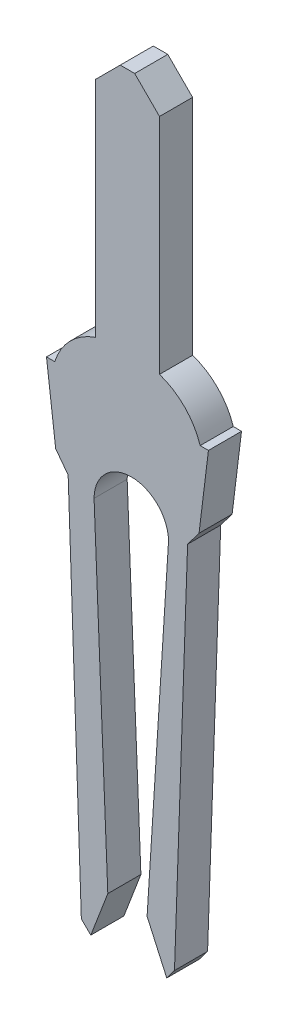
ISO-10303-21;
HEADER;
FILE_DESCRIPTION(('STEP AP214'),'2;1');
FILE_NAME('part.step','',(''),(''),'','','');
FILE_SCHEMA(('AUTOMOTIVE_DESIGN { 1 0 10303 214 1 1 1 1 }'));
ENDSEC;
DATA;
#1=APPLICATION_CONTEXT('core data for automotive mechanical design processes');
#2=APPLICATION_PROTOCOL_DEFINITION('international standard','automotive_design',2000,#1);
#3=PRODUCT_CONTEXT('',#1,'mechanical');
#4=PRODUCT('Part','Part','',(#3));
#5=PRODUCT_RELATED_PRODUCT_CATEGORY('part','',(#4));
#6=PRODUCT_DEFINITION_FORMATION('','',#4);
#7=PRODUCT_DEFINITION_CONTEXT('part definition',#1,'design');
#8=PRODUCT_DEFINITION('design','',#6,#7);
#9=PRODUCT_DEFINITION_SHAPE('','',#8);
#10=(LENGTH_UNIT() NAMED_UNIT(*) SI_UNIT(.MILLI.,.METRE.));
#11=(NAMED_UNIT(*) PLANE_ANGLE_UNIT() SI_UNIT($,.RADIAN.));
#12=(NAMED_UNIT(*) SI_UNIT($,.STERADIAN.) SOLID_ANGLE_UNIT());
#13=UNCERTAINTY_MEASURE_WITH_UNIT(LENGTH_MEASURE(1.E-05),#10,'distance_accuracy_value','');
#14=(GEOMETRIC_REPRESENTATION_CONTEXT(3) GLOBAL_UNCERTAINTY_ASSIGNED_CONTEXT((#13)) GLOBAL_UNIT_ASSIGNED_CONTEXT((#10,
#11,#12)) REPRESENTATION_CONTEXT('',''));
#15=CARTESIAN_POINT('',(0.,0.,0.));
#16=DIRECTION('',(0.,0.,1.));
#17=DIRECTION('',(1.,0.,0.));
#18=AXIS2_PLACEMENT_3D('',#15,#16,#17);
#19=CARTESIAN_POINT('',(1.00634292,-3.0005430718,0.2032));
#20=DIRECTION('',(0.,0.,-1.));
#21=DIRECTION('',(-1.,0.,0.));
#22=AXIS2_PLACEMENT_3D('',#19,#20,#21);
#23=PLANE('',#22);
#24=DIRECTION('',(-0.707106781186548,0.707106781186547,0.));
#25=VECTOR('',#24,1.);
#26=CARTESIAN_POINT('',(0.2413,6.3373,0.2032));
#27=LINE('',#26,#25);
#28=CARTESIAN_POINT('',(0.3937,6.1849,0.2032));
#29=VERTEX_POINT('',#28);
#30=CARTESIAN_POINT('',(0.0888999999999999,6.4897,0.2032));
#31=VERTEX_POINT('',#30);
#32=EDGE_CURVE('E319',#29,#31,#27,.T.);
#33=ORIENTED_EDGE('',*,*,#32,.T.);
#34=DIRECTION('',(-1.,0.,0.));
#35=VECTOR('',#34,1.);
#36=CARTESIAN_POINT('',(0.,6.4897,0.2032));
#37=LINE('',#36,#35);
#38=CARTESIAN_POINT('',(-0.0889,6.4897,0.2032));
#39=VERTEX_POINT('',#38);
#40=EDGE_CURVE('E245',#31,#39,#37,.T.);
#41=ORIENTED_EDGE('',*,*,#40,.T.);
#42=DIRECTION('',(0.707106781186548,0.707106781186547,0.));
#43=VECTOR('',#42,1.);
#44=CARTESIAN_POINT('',(-0.3937,6.1849,0.2032));
#45=LINE('',#44,#43);
#46=CARTESIAN_POINT('',(-0.3937,6.1849,0.2032));
#47=VERTEX_POINT('',#46);
#48=EDGE_CURVE('E243',#47,#39,#45,.T.);
#49=ORIENTED_EDGE('',*,*,#48,.F.);
#50=DIRECTION('',(0.,-1.,0.));
#51=VECTOR('',#50,1.);
#52=CARTESIAN_POINT('',(-0.3937,4.8133,0.2032));
#53=LINE('',#52,#51);
#54=CARTESIAN_POINT('',(-0.393699994942539,3.44170001044365,0.2032));
#55=VERTEX_POINT('',#54);
#56=EDGE_CURVE('E198',#47,#55,#53,.T.);
#57=ORIENTED_EDGE('',*,*,#56,.T.);
#58=CARTESIAN_POINT('',(-0.142300071,2.6955118048,0.2032));
#59=DIRECTION('',(0.,0.,-1.));
#60=DIRECTION('',(0.,1.,0.));
#61=AXIS2_PLACEMENT_3D('',#58,#59,#60);
#62=CIRCLE('',#61,0.7874);
#63=CARTESIAN_POINT('',(-0.892809996860712,2.93369999954243,0.2032));
#64=VERTEX_POINT('',#63);
#65=EDGE_CURVE('E246',#64,#55,#62,.T.);
#66=ORIENTED_EDGE('',*,*,#65,.F.);
#67=DIRECTION('',(1.,0.,0.));
#68=VECTOR('',#67,1.);
#69=CARTESIAN_POINT('',(0.,2.93369999908487,0.2032));
#70=LINE('',#69,#68);
#71=CARTESIAN_POINT('',(-0.994409999943818,2.93369999954243,0.2032));
#72=VERTEX_POINT('',#71);
#73=EDGE_CURVE('E247',#72,#64,#70,.T.);
#74=ORIENTED_EDGE('',*,*,#73,.F.);
#75=DIRECTION('',(-0.121869351263965,0.992546150676381,0.));
#76=VECTOR('',#75,1.);
#77=CARTESIAN_POINT('',(-0.881437581800001,2.0136135496,0.2032));
#78=LINE('',#77,#76);
#79=CARTESIAN_POINT('',(-0.881437581800001,2.0136135496,0.2032));
#80=VERTEX_POINT('',#79);
#81=EDGE_CURVE('E169',#80,#72,#78,.T.);
#82=ORIENTED_EDGE('',*,*,#81,.F.);
#83=DIRECTION('',(-0.601814997630454,0.798635529279193,0.));
#84=VECTOR('',#83,1.);
#85=CARTESIAN_POINT('',(-0.728315409,1.8104135496,0.2032));
#86=LINE('',#85,#84);
#87=CARTESIAN_POINT('',(-0.728315409,1.8104135496,0.2032));
#88=VERTEX_POINT('',#87);
#89=EDGE_CURVE('E20',#88,#80,#86,.T.);
#90=ORIENTED_EDGE('',*,*,#89,.F.);
#91=DIRECTION('',(0.0348994957399031,-0.99939082705271,0.));
#92=VECTOR('',#91,1.);
#93=CARTESIAN_POINT('',(-0.6472905266,-0.5098355691,0.2032));
#94=LINE('',#93,#92);
#95=CARTESIAN_POINT('',(-0.56626564000751,-2.83008468353874,0.2032));
#96=VERTEX_POINT('',#95);
#97=EDGE_CURVE('E167',#88,#96,#94,.T.);
#98=ORIENTED_EDGE('',*,*,#97,.T.);
#99=DIRECTION('',(0.713838053163292,-0.700310812322672,0.));
#100=VECTOR('',#99,1.);
#101=CARTESIAN_POINT('',(-0.508237744,-2.8870129585,0.2032));
#102=LINE('',#101,#100);
#103=CARTESIAN_POINT('',(-0.450209842279361,-2.94394122522615,0.2032));
#104=VERTEX_POINT('',#103);
#105=EDGE_CURVE('E268',#96,#104,#102,.T.);
#106=ORIENTED_EDGE('',*,*,#105,.T.);
#107=DIRECTION('',(0.357388589157681,0.933955778578345,0.));
#108=VECTOR('',#107,1.);
#109=CARTESIAN_POINT('',(-0.3457549219,-2.6709714678,0.2032));
#110=LINE('',#109,#108);
#111=CARTESIAN_POINT('',(-0.2413,-2.3980017064,0.2032));
#112=VERTEX_POINT('',#111);
#113=EDGE_CURVE('E260',#104,#112,#110,.T.);
#114=ORIENTED_EDGE('',*,*,#113,.T.);
#115=DIRECTION('',(-0.0409185260317038,0.999162486399181,0.));
#116=VECTOR('',#115,1.);
#117=CARTESIAN_POINT('',(-0.32565467,-0.3382006825,0.2032));
#118=LINE('',#117,#116);
#119=CARTESIAN_POINT('',(-0.41000934,1.7216003414,0.2032));
#120=VERTEX_POINT('',#119);
#121=EDGE_CURVE('E236',#112,#120,#118,.T.);
#122=ORIENTED_EDGE('',*,*,#121,.T.);
#123=CARTESIAN_POINT('',(0.04719066,1.7216003414,0.2032));
#124=DIRECTION('',(0.,0.,-1.));
#125=DIRECTION('',(0.,1.,0.));
#126=AXIS2_PLACEMENT_3D('',#123,#124,#125);
#127=CIRCLE('',#126,0.4572);
#128=CARTESIAN_POINT('',(0.50439066,1.72160034130623,0.2032));
#129=VERTEX_POINT('',#128);
#130=EDGE_CURVE('E234',#129,#120,#127,.F.);
#131=ORIENTED_EDGE('',*,*,#130,.F.);
#132=DIRECTION('',(-0.0637332890518532,-0.997966967322382,0.));
#133=VECTOR('',#132,1.);
#134=CARTESIAN_POINT('',(0.37284533,-0.3382006825,0.2032));
#135=LINE('',#134,#133);
#136=CARTESIAN_POINT('',(0.2413,-2.3980017064,0.2032));
#137=VERTEX_POINT('',#136);
#138=EDGE_CURVE('E274',#129,#137,#135,.T.);
#139=ORIENTED_EDGE('',*,*,#138,.T.);
#140=DIRECTION('',(0.410489372566883,-0.911865382065602,0.));
#141=VECTOR('',#140,1.);
#142=CARTESIAN_POINT('',(0.3618761622,-2.6658508532,0.2032));
#143=LINE('',#142,#141);
#144=CARTESIAN_POINT('',(0.4824523244,-2.9337,0.2032));
#145=VERTEX_POINT('',#144);
#146=EDGE_CURVE('E281',#137,#145,#143,.T.);
#147=ORIENTED_EDGE('',*,*,#146,.T.);
#148=DIRECTION('',(0.599455636048823,0.800407983724113,0.));
#149=VECTOR('',#148,1.);
#150=CARTESIAN_POINT('',(0.5300524832,-2.8701430913,0.2032));
#151=LINE('',#150,#149);
#152=CARTESIAN_POINT('',(0.577652642,-2.8065861826,0.2032));
#153=VERTEX_POINT('',#152);
#154=EDGE_CURVE('E287',#145,#153,#151,.T.);
#155=ORIENTED_EDGE('',*,*,#154,.T.);
#156=DIRECTION('',(0.0348995011107875,0.999390826865155,0.));
#157=VECTOR('',#156,1.);
#158=CARTESIAN_POINT('',(0.6582352977,-0.4990011356,0.2032));
#159=LINE('',#158,#157);
#160=CARTESIAN_POINT('',(0.7388179534,1.8085839114,0.2032));
#161=VERTEX_POINT('',#160);
#162=EDGE_CURVE('E293',#153,#161,#159,.T.);
#163=ORIENTED_EDGE('',*,*,#162,.T.);
#164=DIRECTION('',(0.6018150374887,0.798635499243851,0.));
#165=VECTOR('',#164,1.);
#166=CARTESIAN_POINT('',(0.8089713818,1.9016806518,0.2032));
#167=LINE('',#166,#165);
#168=CARTESIAN_POINT('',(0.879124810200001,1.9947773922,0.2032));
#169=VERTEX_POINT('',#168);
#170=EDGE_CURVE('E299',#161,#169,#167,.T.);
#171=ORIENTED_EDGE('',*,*,#170,.T.);
#172=DIRECTION('',(0.121869332657226,0.992546152961001,0.));
#173=VECTOR('',#172,1.);
#174=CARTESIAN_POINT('',(0.9367674051,2.4642386961,0.2032));
#175=LINE('',#174,#173);
#176=CARTESIAN_POINT('',(0.99441,2.9337,0.2032));
#177=VERTEX_POINT('',#176);
#178=EDGE_CURVE('E305',#169,#177,#175,.T.);
#179=ORIENTED_EDGE('',*,*,#178,.T.);
#180=DIRECTION('',(-1.,0.,0.));
#181=VECTOR('',#180,1.);
#182=CARTESIAN_POINT('',(0.94361,2.9337,0.2032));
#183=LINE('',#182,#181);
#184=CARTESIAN_POINT('',(0.892809996715494,2.9337,0.2032));
#185=VERTEX_POINT('',#184);
#186=EDGE_CURVE('E311',#177,#185,#183,.T.);
#187=ORIENTED_EDGE('',*,*,#186,.T.);
#188=CARTESIAN_POINT('',(0.142300071,2.6955118048,0.2032));
#189=DIRECTION('',(0.,0.,-1.));
#190=DIRECTION('',(0.,1.,0.));
#191=AXIS2_PLACEMENT_3D('',#188,#189,#190);
#192=CIRCLE('',#191,0.7874);
#193=CARTESIAN_POINT('',(0.393699994722491,3.44170001051779,0.2032));
#194=VERTEX_POINT('',#193);
#195=EDGE_CURVE('E238',#185,#194,#192,.F.);
#196=ORIENTED_EDGE('',*,*,#195,.T.);
#197=DIRECTION('',(0.,1.,0.));
#198=VECTOR('',#197,1.);
#199=CARTESIAN_POINT('',(0.3937,4.8133,0.2032));
#200=LINE('',#199,#198);
#201=EDGE_CURVE('E316',#194,#29,#200,.T.);
#202=ORIENTED_EDGE('',*,*,#201,.T.);
#203=EDGE_LOOP('',(#33,#41,#49,#57,#66,#74,#82,#90,#98,#106,#114,#122,#131,#139,#147,#155,#163,
#171,#179,#187,#196,#202));
#204=FACE_BOUND('',#203,.T.);
#205=ADVANCED_FACE('F16',(#204),#23,.F.);
#206=CARTESIAN_POINT('',(-0.0889,6.4897,0.2032));
#207=DIRECTION('',(0.,-1.,0.));
#208=DIRECTION('',(0.,0.,-1.));
#209=AXIS2_PLACEMENT_3D('',#206,#207,#208);
#210=PLANE('',#209);
#211=DIRECTION('',(0.,0.,-1.));
#212=VECTOR('',#211,1.);
#213=CARTESIAN_POINT('',(0.0889,6.4897,0.));
#214=LINE('',#213,#212);
#215=CARTESIAN_POINT('',(0.0888999997234752,6.4897,-0.2032));
#216=VERTEX_POINT('',#215);
#217=EDGE_CURVE('E323',#31,#216,#214,.T.);
#218=ORIENTED_EDGE('',*,*,#217,.T.);
#219=DIRECTION('',(1.,0.,0.));
#220=VECTOR('',#219,1.);
#221=CARTESIAN_POINT('',(0.,6.4897,-0.2032));
#222=LINE('',#221,#220);
#223=CARTESIAN_POINT('',(-0.0888999997234753,6.4897,-0.2032));
#224=VERTEX_POINT('',#223);
#225=EDGE_CURVE('E187',#224,#216,#222,.T.);
#226=ORIENTED_EDGE('',*,*,#225,.F.);
#227=DIRECTION('',(0.,0.,1.));
#228=VECTOR('',#227,1.);
#229=CARTESIAN_POINT('',(-0.0889,6.4897,0.));
#230=LINE('',#229,#228);
#231=EDGE_CURVE('E193',#224,#39,#230,.T.);
#232=ORIENTED_EDGE('',*,*,#231,.T.);
#233=ORIENTED_EDGE('',*,*,#40,.F.);
#234=EDGE_LOOP('',(#218,#226,#232,#233));
#235=FACE_BOUND('',#234,.T.);
#236=ADVANCED_FACE('F397',(#235),#210,.F.);
#237=CARTESIAN_POINT('',(0.0889,6.4897,-0.2032));
#238=DIRECTION('',(-0.707106781186547,-0.707106781186548,0.));
#239=DIRECTION('',(0.707106781186548,-0.707106781186547,0.));
#240=AXIS2_PLACEMENT_3D('',#237,#238,#239);
#241=PLANE('',#240);
#242=DIRECTION('',(0.,0.,-1.));
#243=VECTOR('',#242,1.);
#244=CARTESIAN_POINT('',(0.3937,6.1849,0.));
#245=LINE('',#244,#243);
#246=CARTESIAN_POINT('',(0.393699999888246,6.18490000158768,-0.2032));
#247=VERTEX_POINT('',#246);
#248=EDGE_CURVE('E242',#29,#247,#245,.T.);
#249=ORIENTED_EDGE('',*,*,#248,.T.);
#250=DIRECTION('',(0.70710678533848,-0.707106777034615,0.));
#251=VECTOR('',#250,1.);
#252=CARTESIAN_POINT('',(0.0888999994469505,6.4897,-0.2032));
#253=LINE('',#252,#251);
#254=EDGE_CURVE('E190',#216,#247,#253,.T.);
#255=ORIENTED_EDGE('',*,*,#254,.F.);
#256=ORIENTED_EDGE('',*,*,#217,.F.);
#257=ORIENTED_EDGE('',*,*,#32,.F.);
#258=EDGE_LOOP('',(#249,#255,#256,#257));
#259=FACE_BOUND('',#258,.T.);
#260=ADVANCED_FACE('F474',(#259),#241,.F.);
#261=CARTESIAN_POINT('',(0.3937,6.1849,-0.2032));
#262=DIRECTION('',(-1.,0.,0.));
#263=DIRECTION('',(0.,-1.,0.));
#264=AXIS2_PLACEMENT_3D('',#261,#262,#263);
#265=PLANE('',#264);
#266=ORIENTED_EDGE('',*,*,#248,.F.);
#267=ORIENTED_EDGE('',*,*,#201,.F.);
#268=DIRECTION('',(0.,0.,1.));
#269=VECTOR('',#268,1.);
#270=CARTESIAN_POINT('',(0.393699989444981,3.44170001229584,0.));
#271=LINE('',#270,#269);
#272=CARTESIAN_POINT('',(0.393699994647987,3.44170001054289,-0.2032));
#273=VERTEX_POINT('',#272);
#274=EDGE_CURVE('E241',#194,#273,#271,.F.);
#275=ORIENTED_EDGE('',*,*,#274,.T.);
#276=DIRECTION('',(0.,-1.,0.));
#277=VECTOR('',#276,1.);
#278=CARTESIAN_POINT('',(0.393699999850994,1.7445784641,-0.2032));
#279=LINE('',#278,#277);
#280=EDGE_CURVE('E232',#247,#273,#279,.T.);
#281=ORIENTED_EDGE('',*,*,#280,.F.);
#282=EDGE_LOOP('',(#266,#267,#275,#281));
#283=FACE_BOUND('',#282,.T.);
#284=ADVANCED_FACE('F471',(#283),#265,.F.);
#285=CARTESIAN_POINT('',(0.142300071,2.6955118048,0.2032));
#286=DIRECTION('',(0.,0.,-1.));
#287=DIRECTION('',(0.,1.,0.));
#288=AXIS2_PLACEMENT_3D('',#285,#286,#287);
#289=CYLINDRICAL_SURFACE('',#288,0.7874);
#290=CARTESIAN_POINT('',(0.142300071,2.6955118048,-0.2032));
#291=DIRECTION('',(0.,0.,-1.));
#292=DIRECTION('',(0.,1.,0.));
#293=AXIS2_PLACEMENT_3D('',#290,#291,#292);
#294=CIRCLE('',#293,0.7874);
#295=CARTESIAN_POINT('',(0.892809996860712,2.93369999954243,-0.2032));
#296=VERTEX_POINT('',#295);
#297=EDGE_CURVE('E230',#273,#296,#294,.T.);
#298=ORIENTED_EDGE('',*,*,#297,.F.);
#299=ORIENTED_EDGE('',*,*,#274,.F.);
#300=ORIENTED_EDGE('',*,*,#195,.F.);
#301=DIRECTION('',(0.,0.,-1.));
#302=VECTOR('',#301,1.);
#303=CARTESIAN_POINT('',(0.89281,2.9337,0.));
#304=LINE('',#303,#302);
#305=EDGE_CURVE('E308',#185,#296,#304,.T.);
#306=ORIENTED_EDGE('',*,*,#305,.T.);
#307=EDGE_LOOP('',(#298,#299,#300,#306));
#308=FACE_BOUND('',#307,.T.);
#309=ADVANCED_FACE('F469',(#308),#289,.T.);
#310=CARTESIAN_POINT('',(0.89281,2.9337,0.2032));
#311=DIRECTION('',(0.,-1.,0.));
#312=DIRECTION('',(0.,0.,-1.));
#313=AXIS2_PLACEMENT_3D('',#310,#311,#312);
#314=PLANE('',#313);
#315=DIRECTION('',(1.,0.,0.));
#316=VECTOR('',#315,1.);
#317=CARTESIAN_POINT('',(0.,2.93369999908487,-0.2032));
#318=LINE('',#317,#316);
#319=CARTESIAN_POINT('',(0.994409999659585,2.93369999955395,-0.2032));
#320=VERTEX_POINT('',#319);
#321=EDGE_CURVE('E229',#296,#320,#318,.T.);
#322=ORIENTED_EDGE('',*,*,#321,.F.);
#323=ORIENTED_EDGE('',*,*,#305,.F.);
#324=ORIENTED_EDGE('',*,*,#186,.F.);
#325=DIRECTION('',(0.,0.,-1.));
#326=VECTOR('',#325,1.);
#327=CARTESIAN_POINT('',(0.99441,2.9337,0.));
#328=LINE('',#327,#326);
#329=EDGE_CURVE('E302',#177,#320,#328,.T.);
#330=ORIENTED_EDGE('',*,*,#329,.T.);
#331=EDGE_LOOP('',(#322,#323,#324,#330));
#332=FACE_BOUND('',#331,.T.);
#333=ADVANCED_FACE('F465',(#332),#314,.F.);
#334=CARTESIAN_POINT('',(0.99441,2.9337,-0.2032));
#335=DIRECTION('',(-0.992546152961001,0.121869332657226,0.));
#336=DIRECTION('',(-0.121869332657226,-0.992546152961001,0.));
#337=AXIS2_PLACEMENT_3D('',#334,#335,#336);
#338=PLANE('',#337);
#339=DIRECTION('',(-0.121869343085154,-0.992546151680612,0.));
#340=VECTOR('',#339,1.);
#341=CARTESIAN_POINT('',(0.994409999506773,2.93369999908487,-0.2032));
#342=LINE('',#341,#340);
#343=CARTESIAN_POINT('',(0.879124803379333,1.99477739295248,-0.2032));
#344=VERTEX_POINT('',#343);
#345=EDGE_CURVE('E227',#320,#344,#342,.T.);
#346=ORIENTED_EDGE('',*,*,#345,.F.);
#347=ORIENTED_EDGE('',*,*,#329,.F.);
#348=ORIENTED_EDGE('',*,*,#178,.F.);
#349=DIRECTION('',(0.,0.,-1.));
#350=VECTOR('',#349,1.);
#351=CARTESIAN_POINT('',(0.879124810200001,1.9947773922,0.));
#352=LINE('',#351,#350);
#353=EDGE_CURVE('E296',#169,#344,#352,.T.);
#354=ORIENTED_EDGE('',*,*,#353,.T.);
#355=EDGE_LOOP('',(#346,#347,#348,#354));
#356=FACE_BOUND('',#355,.T.);
#357=ADVANCED_FACE('F461',(#356),#338,.F.);
#358=CARTESIAN_POINT('',(0.879124810200001,1.9947773922,-0.2032));
#359=DIRECTION('',(-0.798635499243851,0.6018150374887,0.));
#360=DIRECTION('',(-0.6018150374887,-0.798635499243851,0.));
#361=AXIS2_PLACEMENT_3D('',#358,#359,#360);
#362=PLANE('',#361);
#363=DIRECTION('',(-0.601815037244307,-0.798635499428014,0.));
#364=VECTOR('',#363,1.);
#365=CARTESIAN_POINT('',(0.879124799700006,1.99477739133778,-0.2032));
#366=LINE('',#365,#364);
#367=CARTESIAN_POINT('',(0.73881794607367,1.80858391139253,-0.2032));
#368=VERTEX_POINT('',#367);
#369=EDGE_CURVE('E225',#344,#368,#366,.T.);
#370=ORIENTED_EDGE('',*,*,#369,.F.);
#371=ORIENTED_EDGE('',*,*,#353,.F.);
#372=ORIENTED_EDGE('',*,*,#170,.F.);
#373=DIRECTION('',(0.,0.,-1.));
#374=VECTOR('',#373,1.);
#375=CARTESIAN_POINT('',(0.7388179534,1.8085839114,0.));
#376=LINE('',#375,#374);
#377=EDGE_CURVE('E290',#161,#368,#376,.T.);
#378=ORIENTED_EDGE('',*,*,#377,.T.);
#379=EDGE_LOOP('',(#370,#371,#372,#378));
#380=FACE_BOUND('',#379,.T.);
#381=ADVANCED_FACE('F457',(#380),#362,.F.);
#382=CARTESIAN_POINT('',(0.7388179534,1.8085839114,-0.2032));
#383=DIRECTION('',(-0.999390826865155,0.0348995011107875,0.));
#384=DIRECTION('',(-0.0348995011107875,-0.999390826865155,0.));
#385=AXIS2_PLACEMENT_3D('',#382,#383,#384);
#386=PLANE('',#385);
#387=DIRECTION('',(-0.0348994967205745,-0.999390827018465,0.));
#388=VECTOR('',#387,1.);
#389=CARTESIAN_POINT('',(0.738817941860191,1.80858390903935,-0.2032));
#390=LINE('',#389,#388);
#391=CARTESIAN_POINT('',(0.577652648480568,-2.80658618690665,-0.2032));
#392=VERTEX_POINT('',#391);
#393=EDGE_CURVE('E223',#368,#392,#390,.T.);
#394=ORIENTED_EDGE('',*,*,#393,.F.);
#395=ORIENTED_EDGE('',*,*,#377,.F.);
#396=ORIENTED_EDGE('',*,*,#162,.F.);
#397=DIRECTION('',(0.,0.,-1.));
#398=VECTOR('',#397,1.);
#399=CARTESIAN_POINT('',(0.577652642,-2.8065861826,0.));
#400=LINE('',#399,#398);
#401=EDGE_CURVE('E284',#153,#392,#400,.T.);
#402=ORIENTED_EDGE('',*,*,#401,.T.);
#403=EDGE_LOOP('',(#394,#395,#396,#402));
#404=FACE_BOUND('',#403,.T.);
#405=ADVANCED_FACE('F453',(#404),#386,.F.);
#406=CARTESIAN_POINT('',(0.577652642,-2.8065861826,-0.2032));
#407=DIRECTION('',(-0.800407983724113,0.599455636048823,0.));
#408=DIRECTION('',(-0.599455636048823,-0.800407983724113,0.));
#409=AXIS2_PLACEMENT_3D('',#406,#407,#408);
#410=PLANE('',#409);
#411=DIRECTION('',(-0.599455709307943,-0.800407928857599,0.));
#412=VECTOR('',#411,1.);
#413=CARTESIAN_POINT('',(0.577652650545881,-2.80658619105912,-0.2032));
#414=LINE('',#413,#412);
#415=CARTESIAN_POINT('',(0.482452319905707,-2.93370000271729,-0.2032));
#416=VERTEX_POINT('',#415);
#417=EDGE_CURVE('E221',#392,#416,#414,.T.);
#418=ORIENTED_EDGE('',*,*,#417,.F.);
#419=ORIENTED_EDGE('',*,*,#401,.F.);
#420=ORIENTED_EDGE('',*,*,#154,.F.);
#421=DIRECTION('',(0.,0.,-1.));
#422=VECTOR('',#421,1.);
#423=CARTESIAN_POINT('',(0.4824523244,-2.9337,0.));
#424=LINE('',#423,#422);
#425=EDGE_CURVE('E278',#145,#416,#424,.T.);
#426=ORIENTED_EDGE('',*,*,#425,.T.);
#427=EDGE_LOOP('',(#418,#419,#420,#426));
#428=FACE_BOUND('',#427,.T.);
#429=ADVANCED_FACE('F449',(#428),#410,.F.);
#430=CARTESIAN_POINT('',(0.4824523244,-2.9337,-0.2032));
#431=DIRECTION('',(0.911865382065602,0.410489372566883,0.));
#432=DIRECTION('',(-0.410489372566883,0.911865382065602,0.));
#433=AXIS2_PLACEMENT_3D('',#430,#431,#432);
#434=PLANE('',#433);
#435=DIRECTION('',(-0.410489367582358,0.911865384309458,0.));
#436=VECTOR('',#435,1.);
#437=CARTESIAN_POINT('',(0.482452316461748,-2.93370000622121,-0.2032));
#438=LINE('',#437,#436);
#439=CARTESIAN_POINT('',(0.241299999979613,-2.39800171403611,-0.2032));
#440=VERTEX_POINT('',#439);
#441=EDGE_CURVE('E219',#416,#440,#438,.T.);
#442=ORIENTED_EDGE('',*,*,#441,.F.);
#443=ORIENTED_EDGE('',*,*,#425,.F.);
#444=ORIENTED_EDGE('',*,*,#146,.F.);
#445=DIRECTION('',(0.,0.,-1.));
#446=VECTOR('',#445,1.);
#447=CARTESIAN_POINT('',(0.2413,-2.3980017064,0.));
#448=LINE('',#447,#446);
#449=EDGE_CURVE('E277',#137,#440,#448,.T.);
#450=ORIENTED_EDGE('',*,*,#449,.T.);
#451=EDGE_LOOP('',(#442,#443,#444,#450));
#452=FACE_BOUND('',#451,.T.);
#453=ADVANCED_FACE('F445',(#452),#434,.F.);
#454=CARTESIAN_POINT('',(0.2413,-2.3980017064,-0.2032));
#455=DIRECTION('',(0.997966967322382,-0.0637332890518533,0.));
#456=DIRECTION('',(0.0637332890518533,0.997966967322382,0.));
#457=AXIS2_PLACEMENT_3D('',#454,#455,#456);
#458=PLANE('',#457);
#459=DIRECTION('',(0.0637332921702592,0.997966967123231,0.));
#460=VECTOR('',#459,1.);
#461=CARTESIAN_POINT('',(0.241299999648972,-2.39800172165241,-0.2032));
#462=LINE('',#461,#460);
#463=CARTESIAN_POINT('',(0.504390659999975,1.72160023523288,-0.2032));
#464=VERTEX_POINT('',#463);
#465=EDGE_CURVE('E217',#440,#464,#462,.T.);
#466=ORIENTED_EDGE('',*,*,#465,.F.);
#467=ORIENTED_EDGE('',*,*,#449,.F.);
#468=ORIENTED_EDGE('',*,*,#138,.F.);
#469=DIRECTION('',(0.,0.,-1.));
#470=VECTOR('',#469,1.);
#471=CARTESIAN_POINT('',(0.50439066,1.72160034121245,0.));
#472=LINE('',#471,#470);
#473=EDGE_CURVE('E237',#464,#129,#472,.F.);
#474=ORIENTED_EDGE('',*,*,#473,.F.);
#475=EDGE_LOOP('',(#466,#467,#468,#474));
#476=FACE_BOUND('',#475,.T.);
#477=ADVANCED_FACE('F442',(#476),#458,.F.);
#478=CARTESIAN_POINT('',(0.04719066,1.7216003414,0.2032));
#479=DIRECTION('',(0.,0.,-1.));
#480=DIRECTION('',(0.,1.,0.));
#481=AXIS2_PLACEMENT_3D('',#478,#479,#480);
#482=CYLINDRICAL_SURFACE('',#481,0.4572);
#483=ORIENTED_EDGE('',*,*,#473,.T.);
#484=ORIENTED_EDGE('',*,*,#130,.T.);
#485=DIRECTION('',(0.,0.,-1.));
#486=VECTOR('',#485,1.);
#487=CARTESIAN_POINT('',(-0.41000934,1.7216003414,0.));
#488=LINE('',#487,#486);
#489=CARTESIAN_POINT('',(-0.410009339999962,1.72160047351564,-0.2032));
#490=VERTEX_POINT('',#489);
#491=EDGE_CURVE('E257',#120,#490,#488,.T.);
#492=ORIENTED_EDGE('',*,*,#491,.T.);
#493=CARTESIAN_POINT('',(0.04719066,1.7216003414,-0.2032));
#494=DIRECTION('',(0.,0.,-1.));
#495=DIRECTION('',(0.,1.,0.));
#496=AXIS2_PLACEMENT_3D('',#493,#494,#495);
#497=CIRCLE('',#496,0.4572);
#498=EDGE_CURVE('E215',#464,#490,#497,.F.);
#499=ORIENTED_EDGE('',*,*,#498,.F.);
#500=EDGE_LOOP('',(#483,#484,#492,#499));
#501=FACE_BOUND('',#500,.T.);
#502=ADVANCED_FACE('F440',(#501),#482,.F.);
#503=CARTESIAN_POINT('',(-0.41000934,1.7216003414,-0.2032));
#504=DIRECTION('',(-0.999162486399181,-0.0409185260317038,0.));
#505=DIRECTION('',(0.0409185260317038,-0.999162486399181,0.));
#506=AXIS2_PLACEMENT_3D('',#503,#504,#505);
#507=PLANE('',#506);
#508=DIRECTION('',(0.0409185233453176,-0.999162486509196,0.));
#509=VECTOR('',#508,1.);
#510=CARTESIAN_POINT('',(-0.410009328586947,1.72160032694532,-0.2032));
#511=LINE('',#510,#509);
#512=CARTESIAN_POINT('',(-0.241299999892773,-2.39800171402901,-0.2032));
#513=VERTEX_POINT('',#512);
#514=EDGE_CURVE('E213',#490,#513,#511,.T.);
#515=ORIENTED_EDGE('',*,*,#514,.F.);
#516=ORIENTED_EDGE('',*,*,#491,.F.);
#517=ORIENTED_EDGE('',*,*,#121,.F.);
#518=DIRECTION('',(0.,0.,-1.));
#519=VECTOR('',#518,1.);
#520=CARTESIAN_POINT('',(-0.2413,-2.3980017064,0.));
#521=LINE('',#520,#519);
#522=EDGE_CURVE('E263',#112,#513,#521,.T.);
#523=ORIENTED_EDGE('',*,*,#522,.T.);
#524=EDGE_LOOP('',(#515,#516,#517,#523));
#525=FACE_BOUND('',#524,.T.);
#526=ADVANCED_FACE('F436',(#525),#507,.F.);
#527=CARTESIAN_POINT('',(-0.2413,-2.3980017064,-0.2032));
#528=DIRECTION('',(-0.933955778578345,0.35738858915768,0.));
#529=DIRECTION('',(-0.357388589157681,-0.933955778578345,0.));
#530=AXIS2_PLACEMENT_3D('',#527,#528,#529);
#531=PLANE('',#530);
#532=DIRECTION('',(-0.357388612064806,-0.933955769812677,0.));
#533=VECTOR('',#532,1.);
#534=CARTESIAN_POINT('',(-0.241299999648972,-2.39800172165242,-0.2032));
#535=LINE('',#534,#533);
#536=CARTESIAN_POINT('',(-0.450209846787419,-2.94394122529294,-0.2032));
#537=VERTEX_POINT('',#536);
#538=EDGE_CURVE('E211',#513,#537,#535,.T.);
#539=ORIENTED_EDGE('',*,*,#538,.F.);
#540=ORIENTED_EDGE('',*,*,#522,.F.);
#541=ORIENTED_EDGE('',*,*,#113,.F.);
#542=DIRECTION('',(0.,0.,-1.));
#543=VECTOR('',#542,1.);
#544=CARTESIAN_POINT('',(-0.4502098438,-2.9439412292,0.));
#545=LINE('',#544,#543);
#546=EDGE_CURVE('E183',#104,#537,#545,.T.);
#547=ORIENTED_EDGE('',*,*,#546,.T.);
#548=EDGE_LOOP('',(#539,#540,#541,#547));
#549=FACE_BOUND('',#548,.T.);
#550=ADVANCED_FACE('F432',(#549),#531,.F.);
#551=CARTESIAN_POINT('',(-0.4502098438,-2.9439412292,-0.2032));
#552=DIRECTION('',(0.700310812322672,0.713838053163292,0.));
#553=DIRECTION('',(-0.713838053163292,0.700310812322672,0.));
#554=AXIS2_PLACEMENT_3D('',#551,#552,#553);
#555=PLANE('',#554);
#556=DIRECTION('',(-0.713838005666346,0.700310860737068,0.));
#557=VECTOR('',#556,1.);
#558=CARTESIAN_POINT('',(-0.450209850100196,-2.94394122171753,-0.2032));
#559=LINE('',#558,#557);
#560=CARTESIAN_POINT('',(-0.566265638622206,-2.8300846829539,-0.2032));
#561=VERTEX_POINT('',#560);
#562=EDGE_CURVE('E209',#537,#561,#559,.T.);
#563=ORIENTED_EDGE('',*,*,#562,.F.);
#564=ORIENTED_EDGE('',*,*,#546,.F.);
#565=ORIENTED_EDGE('',*,*,#105,.F.);
#566=DIRECTION('',(0.,0.,-1.));
#567=VECTOR('',#566,1.);
#568=CARTESIAN_POINT('',(-0.5662656442,-2.8300846878,0.));
#569=LINE('',#568,#567);
#570=EDGE_CURVE('E182',#96,#561,#569,.T.);
#571=ORIENTED_EDGE('',*,*,#570,.T.);
#572=EDGE_LOOP('',(#563,#564,#565,#571));
#573=FACE_BOUND('',#572,.T.);
#574=ADVANCED_FACE('F429',(#573),#555,.F.);
#575=CARTESIAN_POINT('',(-0.5662656442,-2.8300846878,-0.2032));
#576=DIRECTION('',(0.99939082705271,0.0348994957399031,0.));
#577=DIRECTION('',(-0.0348994957399031,0.99939082705271,0.));
#578=AXIS2_PLACEMENT_3D('',#575,#576,#577);
#579=PLANE('',#578);
#580=DIRECTION('',(-0.0348994965790994,0.999390827023405,0.));
#581=VECTOR('',#580,1.);
#582=CARTESIAN_POINT('',(-0.566265636871095,-2.83008467824142,-0.2032));
#583=LINE('',#582,#581);
#584=CARTESIAN_POINT('',(-0.728315407210054,1.81041354588383,-0.2032));
#585=VERTEX_POINT('',#584);
#586=EDGE_CURVE('E207',#561,#585,#583,.T.);
#587=ORIENTED_EDGE('',*,*,#586,.F.);
#588=ORIENTED_EDGE('',*,*,#570,.F.);
#589=ORIENTED_EDGE('',*,*,#97,.F.);
#590=DIRECTION('',(0.,0.,-1.));
#591=VECTOR('',#590,1.);
#592=CARTESIAN_POINT('',(-0.728315409,1.8104135496,0.));
#593=LINE('',#592,#591);
#594=EDGE_CURVE('E179',#88,#585,#593,.T.);
#595=ORIENTED_EDGE('',*,*,#594,.T.);
#596=EDGE_LOOP('',(#587,#588,#589,#595));
#597=FACE_BOUND('',#596,.T.);
#598=ADVANCED_FACE('F178',(#597),#579,.F.);
#599=CARTESIAN_POINT('',(-0.3937,3.4417,-0.2032));
#600=DIRECTION('',(1.,0.,0.));
#601=DIRECTION('',(0.,1.,0.));
#602=AXIS2_PLACEMENT_3D('',#599,#600,#601);
#603=PLANE('',#602);
#604=DIRECTION('',(0.,0.,-1.));
#605=VECTOR('',#604,1.);
#606=CARTESIAN_POINT('',(-0.3937,6.1849,0.));
#607=LINE('',#606,#605);
#608=CARTESIAN_POINT('',(-0.393699999888246,6.18490000158768,-0.2032));
#609=VERTEX_POINT('',#608);
#610=EDGE_CURVE('E342',#47,#609,#607,.T.);
#611=ORIENTED_EDGE('',*,*,#610,.T.);
#612=DIRECTION('',(0.,1.,0.));
#613=VECTOR('',#612,1.);
#614=CARTESIAN_POINT('',(-0.393699999850994,1.7445784641,-0.2032));
#615=LINE('',#614,#613);
#616=CARTESIAN_POINT('',(-0.393699994868036,3.44170001046875,-0.2032));
#617=VERTEX_POINT('',#616);
#618=EDGE_CURVE('E202',#617,#609,#615,.T.);
#619=ORIENTED_EDGE('',*,*,#618,.F.);
#620=DIRECTION('',(0.,0.,-1.));
#621=VECTOR('',#620,1.);
#622=CARTESIAN_POINT('',(-0.393699989885078,3.44170001214757,0.));
#623=LINE('',#622,#621);
#624=EDGE_CURVE('E188',#617,#55,#623,.F.);
#625=ORIENTED_EDGE('',*,*,#624,.T.);
#626=ORIENTED_EDGE('',*,*,#56,.F.);
#627=EDGE_LOOP('',(#611,#619,#625,#626));
#628=FACE_BOUND('',#627,.T.);
#629=ADVANCED_FACE('F407',(#628),#603,.F.);
#630=CARTESIAN_POINT('',(-0.3937,6.1849,-0.2032));
#631=DIRECTION('',(0.707106781186547,-0.707106781186548,0.));
#632=DIRECTION('',(0.707106781186548,0.707106781186547,0.));
#633=AXIS2_PLACEMENT_3D('',#630,#631,#632);
#634=PLANE('',#633);
#635=ORIENTED_EDGE('',*,*,#231,.F.);
#636=DIRECTION('',(0.70710678533848,0.707106777034615,0.));
#637=VECTOR('',#636,1.);
#638=CARTESIAN_POINT('',(-0.393699999850994,6.18490000317536,-0.2032));
#639=LINE('',#638,#637);
#640=EDGE_CURVE('E199',#609,#224,#639,.T.);
#641=ORIENTED_EDGE('',*,*,#640,.F.);
#642=ORIENTED_EDGE('',*,*,#610,.F.);
#643=ORIENTED_EDGE('',*,*,#48,.T.);
#644=EDGE_LOOP('',(#635,#641,#642,#643));
#645=FACE_BOUND('',#644,.T.);
#646=ADVANCED_FACE('F400',(#645),#634,.F.);
#647=CARTESIAN_POINT('',(-0.142300071,2.6955118048,0.2032));
#648=DIRECTION('',(0.,0.,-1.));
#649=DIRECTION('',(0.,1.,0.));
#650=AXIS2_PLACEMENT_3D('',#647,#648,#649);
#651=CYLINDRICAL_SURFACE('',#650,0.7874);
#652=CARTESIAN_POINT('',(-0.142300071,2.6955118048,-0.2032));
#653=DIRECTION('',(0.,0.,-1.));
#654=DIRECTION('',(0.,1.,0.));
#655=AXIS2_PLACEMENT_3D('',#652,#653,#654);
#656=CIRCLE('',#655,0.7874);
#657=CARTESIAN_POINT('',(-0.892809996715494,2.9337,-0.2032));
#658=VERTEX_POINT('',#657);
#659=EDGE_CURVE('E203',#658,#617,#656,.T.);
#660=ORIENTED_EDGE('',*,*,#659,.F.);
#661=DIRECTION('',(0.,0.,1.));
#662=VECTOR('',#661,1.);
#663=CARTESIAN_POINT('',(-0.89281,2.9337,0.));
#664=LINE('',#663,#662);
#665=EDGE_CURVE('E326',#658,#64,#664,.T.);
#666=ORIENTED_EDGE('',*,*,#665,.T.);
#667=ORIENTED_EDGE('',*,*,#65,.T.);
#668=ORIENTED_EDGE('',*,*,#624,.F.);
#669=EDGE_LOOP('',(#660,#666,#667,#668));
#670=FACE_BOUND('',#669,.T.);
#671=ADVANCED_FACE('F408',(#670),#651,.T.);
#672=CARTESIAN_POINT('',(-0.728315409,1.8104135496,-0.2032));
#673=DIRECTION('',(0.798635529279193,0.601814997630454,0.));
#674=DIRECTION('',(-0.601814997630454,0.798635529279193,0.));
#675=AXIS2_PLACEMENT_3D('',#672,#673,#674);
#676=PLANE('',#675);
#677=DIRECTION('',(-0.60181502991719,0.798635504949393,0.));
#678=VECTOR('',#677,1.);
#679=CARTESIAN_POINT('',(-0.728315404990478,1.8104135424914,-0.2032));
#680=LINE('',#679,#678);
#681=CARTESIAN_POINT('',(-0.88143758041532,2.01361353832268,-0.2032));
#682=VERTEX_POINT('',#681);
#683=EDGE_CURVE('E186',#585,#682,#680,.T.);
#684=ORIENTED_EDGE('',*,*,#683,.F.);
#685=ORIENTED_EDGE('',*,*,#594,.F.);
#686=ORIENTED_EDGE('',*,*,#89,.T.);
#687=DIRECTION('',(0.,0.,-1.));
#688=VECTOR('',#687,1.);
#689=CARTESIAN_POINT('',(-0.881437581800001,2.0136135496,0.));
#690=LINE('',#689,#688);
#691=EDGE_CURVE('E325',#80,#682,#690,.T.);
#692=ORIENTED_EDGE('',*,*,#691,.T.);
#693=EDGE_LOOP('',(#684,#685,#686,#692));
#694=FACE_BOUND('',#693,.T.);
#695=ADVANCED_FACE('F185',(#694),#676,.F.);
#696=CARTESIAN_POINT('',(1.00634292,-3.0005430718,-0.2032));
#697=DIRECTION('',(0.,0.,-1.));
#698=DIRECTION('',(-1.,0.,0.));
#699=AXIS2_PLACEMENT_3D('',#696,#697,#698);
#700=PLANE('',#699);
#701=ORIENTED_EDGE('',*,*,#618,.T.);
#702=ORIENTED_EDGE('',*,*,#640,.T.);
#703=ORIENTED_EDGE('',*,*,#225,.T.);
#704=ORIENTED_EDGE('',*,*,#254,.T.);
#705=ORIENTED_EDGE('',*,*,#280,.T.);
#706=ORIENTED_EDGE('',*,*,#297,.T.);
#707=ORIENTED_EDGE('',*,*,#321,.T.);
#708=ORIENTED_EDGE('',*,*,#345,.T.);
#709=ORIENTED_EDGE('',*,*,#369,.T.);
#710=ORIENTED_EDGE('',*,*,#393,.T.);
#711=ORIENTED_EDGE('',*,*,#417,.T.);
#712=ORIENTED_EDGE('',*,*,#441,.T.);
#713=ORIENTED_EDGE('',*,*,#465,.T.);
#714=ORIENTED_EDGE('',*,*,#498,.T.);
#715=ORIENTED_EDGE('',*,*,#514,.T.);
#716=ORIENTED_EDGE('',*,*,#538,.T.);
#717=ORIENTED_EDGE('',*,*,#562,.T.);
#718=ORIENTED_EDGE('',*,*,#586,.T.);
#719=ORIENTED_EDGE('',*,*,#683,.T.);
#720=DIRECTION('',(-0.121869351263965,0.992546150676381,0.));
#721=VECTOR('',#720,1.);
#722=CARTESIAN_POINT('',(-0.9379237909,2.4736567748,-0.2032));
#723=LINE('',#722,#721);
#724=CARTESIAN_POINT('',(-0.994409999753387,2.9337,-0.2032));
#725=VERTEX_POINT('',#724);
#726=EDGE_CURVE('E26',#682,#725,#723,.T.);
#727=ORIENTED_EDGE('',*,*,#726,.T.);
#728=DIRECTION('',(1.,0.,0.));
#729=VECTOR('',#728,1.);
#730=CARTESIAN_POINT('',(-0.94361,2.9337,-0.2032));
#731=LINE('',#730,#729);
#732=EDGE_CURVE('E34',#725,#658,#731,.T.);
#733=ORIENTED_EDGE('',*,*,#732,.T.);
#734=ORIENTED_EDGE('',*,*,#659,.T.);
#735=EDGE_LOOP('',(#701,#702,#703,#704,#705,#706,#707,#708,#709,#710,#711,#712,#713,#714,#715,
#716,#717,#718,#719,#727,#733,#734));
#736=FACE_BOUND('',#735,.T.);
#737=ADVANCED_FACE('F403',(#736),#700,.T.);
#738=CARTESIAN_POINT('',(-0.99441,2.9337,-0.2032));
#739=DIRECTION('',(0.,-1.,0.));
#740=DIRECTION('',(1.,0.,0.));
#741=AXIS2_PLACEMENT_3D('',#738,#739,#740);
#742=PLANE('',#741);
#743=ORIENTED_EDGE('',*,*,#732,.F.);
#744=DIRECTION('',(0.,0.,1.));
#745=VECTOR('',#744,1.);
#746=CARTESIAN_POINT('',(-0.99441,2.9337,0.));
#747=LINE('',#746,#745);
#748=EDGE_CURVE('E11',#725,#72,#747,.T.);
#749=ORIENTED_EDGE('',*,*,#748,.T.);
#750=ORIENTED_EDGE('',*,*,#73,.T.);
#751=ORIENTED_EDGE('',*,*,#665,.F.);
#752=EDGE_LOOP('',(#743,#749,#750,#751));
#753=FACE_BOUND('',#752,.T.);
#754=ADVANCED_FACE('F409',(#753),#742,.F.);
#755=CARTESIAN_POINT('',(-0.881437581800001,2.0136135496,-0.2032));
#756=DIRECTION('',(0.992546150676381,0.121869351263965,0.));
#757=DIRECTION('',(-0.121869351263965,0.992546150676381,0.));
#758=AXIS2_PLACEMENT_3D('',#755,#756,#757);
#759=PLANE('',#758);
#760=ORIENTED_EDGE('',*,*,#726,.F.);
#761=ORIENTED_EDGE('',*,*,#691,.F.);
#762=ORIENTED_EDGE('',*,*,#81,.T.);
#763=ORIENTED_EDGE('',*,*,#748,.F.);
#764=EDGE_LOOP('',(#760,#761,#762,#763));
#765=FACE_BOUND('',#764,.T.);
#766=ADVANCED_FACE('F18',(#765),#759,.F.);
#767=CLOSED_SHELL('',(#205,#236,#260,#284,#309,#333,#357,#381,#405,#429,#453,#477,#502,#526,
#550,#574,#598,#629,#646,#671,#695,#737,#754,#766));
#768=MANIFOLD_SOLID_BREP('B1',#767);
#769=ADVANCED_BREP_SHAPE_REPRESENTATION('',(#18,#768),#14);
#770=SHAPE_DEFINITION_REPRESENTATION(#9,#769);
ENDSEC;
END-ISO-10303-21;
